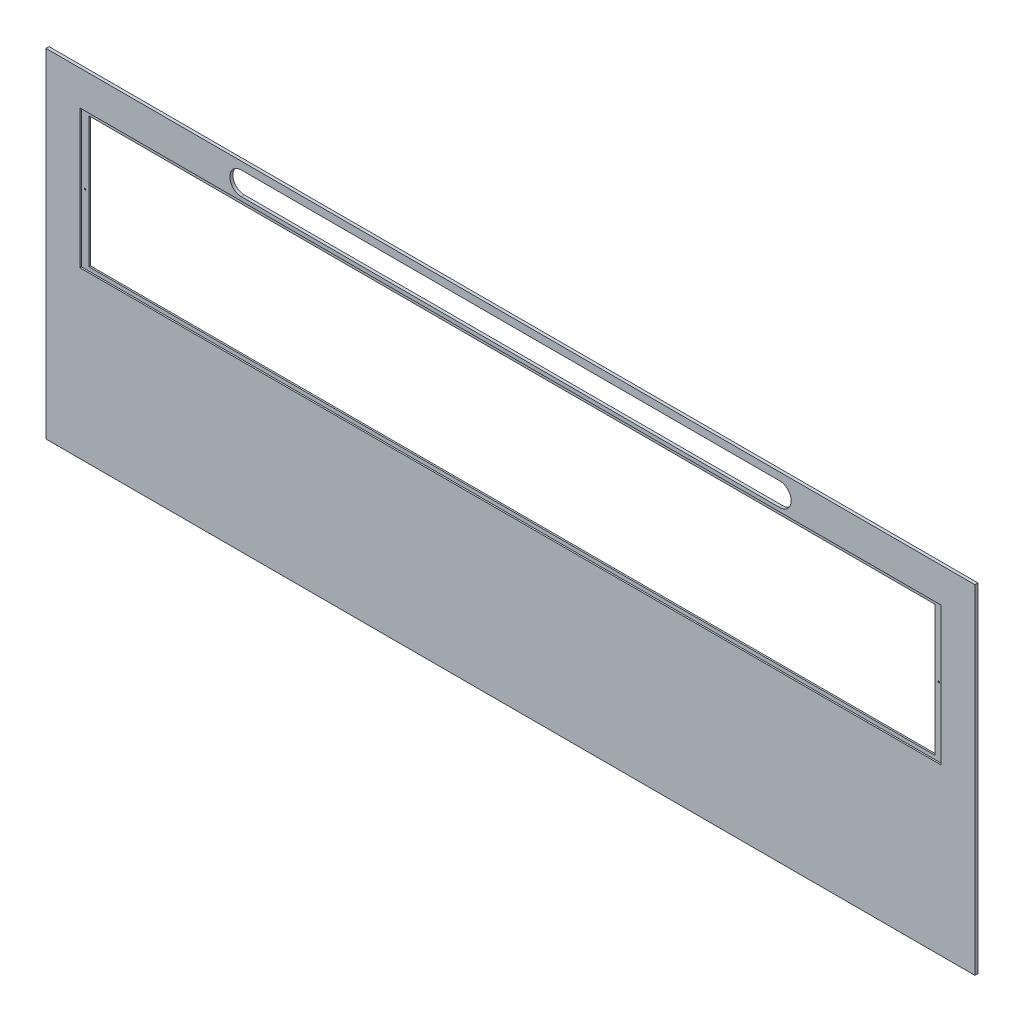
ISO-10303-21;
HEADER;
FILE_DESCRIPTION(('STEP AP214'),'2;1');
FILE_NAME('part.step','',(''),(''),'','','');
FILE_SCHEMA(('AUTOMOTIVE_DESIGN { 1 0 10303 214 1 1 1 1 }'));
ENDSEC;
DATA;
#1=APPLICATION_CONTEXT('core data for automotive mechanical design processes');
#2=APPLICATION_PROTOCOL_DEFINITION('international standard','automotive_design',2000,#1);
#3=PRODUCT_CONTEXT('',#1,'mechanical');
#4=PRODUCT('Part','Part','',(#3));
#5=PRODUCT_RELATED_PRODUCT_CATEGORY('part','',(#4));
#6=PRODUCT_DEFINITION_FORMATION('','',#4);
#7=PRODUCT_DEFINITION_CONTEXT('part definition',#1,'design');
#8=PRODUCT_DEFINITION('design','',#6,#7);
#9=PRODUCT_DEFINITION_SHAPE('','',#8);
#10=(LENGTH_UNIT() NAMED_UNIT(*) SI_UNIT(.MILLI.,.METRE.));
#11=(NAMED_UNIT(*) PLANE_ANGLE_UNIT() SI_UNIT($,.RADIAN.));
#12=(NAMED_UNIT(*) SI_UNIT($,.STERADIAN.) SOLID_ANGLE_UNIT());
#13=UNCERTAINTY_MEASURE_WITH_UNIT(LENGTH_MEASURE(1.E-05),#10,'distance_accuracy_value','');
#14=(GEOMETRIC_REPRESENTATION_CONTEXT(3) GLOBAL_UNCERTAINTY_ASSIGNED_CONTEXT((#13)) GLOBAL_UNIT_ASSIGNED_CONTEXT((#10,
#11,#12)) REPRESENTATION_CONTEXT('',''));
#15=CARTESIAN_POINT('',(0.,0.,0.));
#16=DIRECTION('',(0.,0.,1.));
#17=DIRECTION('',(1.,0.,0.));
#18=AXIS2_PLACEMENT_3D('',#15,#16,#17);
#19=CARTESIAN_POINT('',(0.,0.,2.));
#20=DIRECTION('',(0.,0.,-1.));
#21=DIRECTION('',(-1.,0.,0.));
#22=AXIS2_PLACEMENT_3D('',#19,#20,#21);
#23=PLANE('',#22);
#24=CARTESIAN_POINT('',(555.,85.0000000000004,2.));
#25=DIRECTION('',(0.,0.,-1.));
#26=DIRECTION('',(-1.,0.,0.));
#27=AXIS2_PLACEMENT_3D('',#24,#25,#26);
#28=CIRCLE('',#27,1.00000000000005);
#29=CARTESIAN_POINT('',(554.,85.0000000000004,2.));
#30=VERTEX_POINT('',#29);
#31=EDGE_CURVE('E574',#30,#30,#28,.T.);
#32=ORIENTED_EDGE('',*,*,#31,.T.);
#33=EDGE_LOOP('',(#32));
#34=FACE_BOUND('',#33,.T.);
#35=CARTESIAN_POINT('',(-555.,85.0000000000004,2.));
#36=DIRECTION('',(0.,0.,1.));
#37=DIRECTION('',(1.,0.,0.));
#38=AXIS2_PLACEMENT_3D('',#35,#36,#37);
#39=CIRCLE('',#38,1.00000000000005);
#40=CARTESIAN_POINT('',(-554.,85.0000000000004,2.));
#41=VERTEX_POINT('',#40);
#42=EDGE_CURVE('E181',#41,#41,#39,.T.);
#43=ORIENTED_EDGE('',*,*,#42,.F.);
#44=EDGE_LOOP('',(#43));
#45=FACE_BOUND('',#44,.T.);
#46=DIRECTION('',(0.,1.,0.));
#47=VECTOR('',#46,1.);
#48=CARTESIAN_POINT('',(560.,-4.99999999999989,2.));
#49=LINE('',#48,#47);
#50=CARTESIAN_POINT('',(560.,-4.99999999999989,2.));
#51=VERTEX_POINT('',#50);
#52=CARTESIAN_POINT('',(560.,175.,2.));
#53=VERTEX_POINT('',#52);
#54=EDGE_CURVE('E205',#51,#53,#49,.T.);
#55=ORIENTED_EDGE('',*,*,#54,.T.);
#56=DIRECTION('',(-1.,0.,0.));
#57=VECTOR('',#56,1.);
#58=CARTESIAN_POINT('',(-560.,175.,2.));
#59=LINE('',#58,#57);
#60=CARTESIAN_POINT('',(-560.,175.,2.));
#61=VERTEX_POINT('',#60);
#62=EDGE_CURVE('E209',#53,#61,#59,.T.);
#63=ORIENTED_EDGE('',*,*,#62,.T.);
#64=DIRECTION('',(0.,-1.,0.));
#65=VECTOR('',#64,1.);
#66=CARTESIAN_POINT('',(-560.,175.,2.));
#67=LINE('',#66,#65);
#68=CARTESIAN_POINT('',(-560.,-4.99999999999989,2.));
#69=VERTEX_POINT('',#68);
#70=EDGE_CURVE('E214',#61,#69,#67,.T.);
#71=ORIENTED_EDGE('',*,*,#70,.T.);
#72=DIRECTION('',(1.,0.,0.));
#73=VECTOR('',#72,1.);
#74=CARTESIAN_POINT('',(-560.,-4.99999999999989,2.));
#75=LINE('',#74,#73);
#76=EDGE_CURVE('E218',#69,#51,#75,.T.);
#77=ORIENTED_EDGE('',*,*,#76,.T.);
#78=EDGE_LOOP('',(#55,#63,#71,#77));
#79=FACE_BOUND('',#78,.T.);
#80=DIRECTION('',(0.,1.,0.));
#81=VECTOR('',#80,1.);
#82=CARTESIAN_POINT('',(550.,0.,2.));
#83=LINE('',#82,#81);
#84=CARTESIAN_POINT('',(550.,0.,2.));
#85=VERTEX_POINT('',#84);
#86=CARTESIAN_POINT('',(550.,170.,2.));
#87=VERTEX_POINT('',#86);
#88=EDGE_CURVE('E157',#85,#87,#83,.T.);
#89=ORIENTED_EDGE('',*,*,#88,.F.);
#90=DIRECTION('',(1.,0.,0.));
#91=VECTOR('',#90,1.);
#92=CARTESIAN_POINT('',(-550.,1.94289029309402E-13,2.));
#93=LINE('',#92,#91);
#94=CARTESIAN_POINT('',(-550.,1.94289029309402E-13,2.));
#95=VERTEX_POINT('',#94);
#96=EDGE_CURVE('E175',#95,#85,#93,.T.);
#97=ORIENTED_EDGE('',*,*,#96,.F.);
#98=DIRECTION('',(0.,-1.,0.));
#99=VECTOR('',#98,1.);
#100=CARTESIAN_POINT('',(-550.,170.,2.));
#101=LINE('',#100,#99);
#102=CARTESIAN_POINT('',(-550.,170.,2.));
#103=VERTEX_POINT('',#102);
#104=EDGE_CURVE('E54',#103,#95,#101,.T.);
#105=ORIENTED_EDGE('',*,*,#104,.F.);
#106=DIRECTION('',(-1.,0.,0.));
#107=VECTOR('',#106,1.);
#108=CARTESIAN_POINT('',(-550.,170.,2.));
#109=LINE('',#108,#107);
#110=EDGE_CURVE('E190',#87,#103,#109,.T.);
#111=ORIENTED_EDGE('',*,*,#110,.F.);
#112=EDGE_LOOP('',(#89,#97,#105,#111));
#113=FACE_BOUND('',#112,.T.);
#114=ADVANCED_FACE('F38',(#34,#45,#79,#113),#23,.F.);
#115=CARTESIAN_POINT('',(604.,-220.,4.));
#116=DIRECTION('',(-1.,0.,0.));
#117=DIRECTION('',(0.,0.,1.));
#118=AXIS2_PLACEMENT_3D('',#115,#116,#117);
#119=PLANE('',#118);
#120=DIRECTION('',(0.,1.,0.));
#121=VECTOR('',#120,1.);
#122=CARTESIAN_POINT('',(604.,-220.,0.));
#123=LINE('',#122,#121);
#124=CARTESIAN_POINT('',(604.,-220.,0.));
#125=VERTEX_POINT('',#124);
#126=CARTESIAN_POINT('',(604.,220.,0.));
#127=VERTEX_POINT('',#126);
#128=EDGE_CURVE('E267',#125,#127,#123,.T.);
#129=ORIENTED_EDGE('',*,*,#128,.T.);
#130=DIRECTION('',(0.,0.,-1.));
#131=VECTOR('',#130,1.);
#132=CARTESIAN_POINT('',(604.,220.,4.));
#133=LINE('',#132,#131);
#134=CARTESIAN_POINT('',(604.,220.,4.));
#135=VERTEX_POINT('',#134);
#136=EDGE_CURVE('E314',#135,#127,#133,.T.);
#137=ORIENTED_EDGE('',*,*,#136,.F.);
#138=DIRECTION('',(0.,1.,0.));
#139=VECTOR('',#138,1.);
#140=CARTESIAN_POINT('',(604.,-220.,4.));
#141=LINE('',#140,#139);
#142=CARTESIAN_POINT('',(604.,-220.,4.));
#143=VERTEX_POINT('',#142);
#144=EDGE_CURVE('E277',#143,#135,#141,.T.);
#145=ORIENTED_EDGE('',*,*,#144,.F.);
#146=DIRECTION('',(0.,0.,-1.));
#147=VECTOR('',#146,1.);
#148=CARTESIAN_POINT('',(604.,-220.,4.));
#149=LINE('',#148,#147);
#150=EDGE_CURVE('E291',#143,#125,#149,.T.);
#151=ORIENTED_EDGE('',*,*,#150,.T.);
#152=EDGE_LOOP('',(#129,#137,#145,#151));
#153=FACE_BOUND('',#152,.T.);
#154=ADVANCED_FACE('F40',(#153),#119,.F.);
#155=CARTESIAN_POINT('',(-604.,220.,4.));
#156=DIRECTION('',(0.,-1.,0.));
#157=DIRECTION('',(0.,0.,-1.));
#158=AXIS2_PLACEMENT_3D('',#155,#156,#157);
#159=PLANE('',#158);
#160=DIRECTION('',(-1.,0.,0.));
#161=VECTOR('',#160,1.);
#162=CARTESIAN_POINT('',(-604.,220.,0.));
#163=LINE('',#162,#161);
#164=CARTESIAN_POINT('',(-604.,220.,0.));
#165=VERTEX_POINT('',#164);
#166=EDGE_CURVE('E295',#127,#165,#163,.T.);
#167=ORIENTED_EDGE('',*,*,#166,.T.);
#168=DIRECTION('',(0.,0.,-1.));
#169=VECTOR('',#168,1.);
#170=CARTESIAN_POINT('',(-604.,220.,4.));
#171=LINE('',#170,#169);
#172=CARTESIAN_POINT('',(-604.,220.,4.));
#173=VERTEX_POINT('',#172);
#174=EDGE_CURVE('E310',#173,#165,#171,.T.);
#175=ORIENTED_EDGE('',*,*,#174,.F.);
#176=DIRECTION('',(-1.,0.,0.));
#177=VECTOR('',#176,1.);
#178=CARTESIAN_POINT('',(-604.,220.,4.));
#179=LINE('',#178,#177);
#180=EDGE_CURVE('E281',#135,#173,#179,.T.);
#181=ORIENTED_EDGE('',*,*,#180,.F.);
#182=ORIENTED_EDGE('',*,*,#136,.T.);
#183=EDGE_LOOP('',(#167,#175,#181,#182));
#184=FACE_BOUND('',#183,.T.);
#185=ADVANCED_FACE('F360',(#184),#159,.F.);
#186=CARTESIAN_POINT('',(-604.,-220.,4.));
#187=DIRECTION('',(1.,0.,0.));
#188=DIRECTION('',(0.,0.,-1.));
#189=AXIS2_PLACEMENT_3D('',#186,#187,#188);
#190=PLANE('',#189);
#191=DIRECTION('',(0.,-1.,0.));
#192=VECTOR('',#191,1.);
#193=CARTESIAN_POINT('',(-604.,-220.,0.));
#194=LINE('',#193,#192);
#195=CARTESIAN_POINT('',(-604.,-220.,0.));
#196=VERTEX_POINT('',#195);
#197=EDGE_CURVE('E298',#165,#196,#194,.T.);
#198=ORIENTED_EDGE('',*,*,#197,.T.);
#199=DIRECTION('',(0.,0.,-1.));
#200=VECTOR('',#199,1.);
#201=CARTESIAN_POINT('',(-604.,-220.,4.));
#202=LINE('',#201,#200);
#203=CARTESIAN_POINT('',(-604.,-220.,4.));
#204=VERTEX_POINT('',#203);
#205=EDGE_CURVE('E306',#204,#196,#202,.T.);
#206=ORIENTED_EDGE('',*,*,#205,.F.);
#207=DIRECTION('',(0.,-1.,0.));
#208=VECTOR('',#207,1.);
#209=CARTESIAN_POINT('',(-604.,-220.,4.));
#210=LINE('',#209,#208);
#211=EDGE_CURVE('E285',#173,#204,#210,.T.);
#212=ORIENTED_EDGE('',*,*,#211,.F.);
#213=ORIENTED_EDGE('',*,*,#174,.T.);
#214=EDGE_LOOP('',(#198,#206,#212,#213));
#215=FACE_BOUND('',#214,.T.);
#216=ADVANCED_FACE('F365',(#215),#190,.F.);
#217=CARTESIAN_POINT('',(-604.,-220.,4.));
#218=DIRECTION('',(0.,1.,0.));
#219=DIRECTION('',(0.,0.,1.));
#220=AXIS2_PLACEMENT_3D('',#217,#218,#219);
#221=PLANE('',#220);
#222=DIRECTION('',(1.,0.,0.));
#223=VECTOR('',#222,1.);
#224=CARTESIAN_POINT('',(-604.,-220.,0.));
#225=LINE('',#224,#223);
#226=EDGE_CURVE('E282',#196,#125,#225,.T.);
#227=ORIENTED_EDGE('',*,*,#226,.T.);
#228=ORIENTED_EDGE('',*,*,#150,.F.);
#229=DIRECTION('',(1.,0.,0.));
#230=VECTOR('',#229,1.);
#231=CARTESIAN_POINT('',(-604.,-220.,4.));
#232=LINE('',#231,#230);
#233=EDGE_CURVE('E288',#204,#143,#232,.T.);
#234=ORIENTED_EDGE('',*,*,#233,.F.);
#235=ORIENTED_EDGE('',*,*,#205,.T.);
#236=EDGE_LOOP('',(#227,#228,#234,#235));
#237=FACE_BOUND('',#236,.T.);
#238=ADVANCED_FACE('F349',(#237),#221,.F.);
#239=CARTESIAN_POINT('',(0.,0.,4.));
#240=DIRECTION('',(0.,0.,-1.));
#241=DIRECTION('',(-1.,0.,0.));
#242=AXIS2_PLACEMENT_3D('',#239,#240,#241);
#243=PLANE('',#242);
#244=DIRECTION('',(-1.,0.,0.));
#245=VECTOR('',#244,1.);
#246=CARTESIAN_POINT('',(-560.,175.,4.));
#247=LINE('',#246,#245);
#248=CARTESIAN_POINT('',(560.,175.,4.));
#249=VERTEX_POINT('',#248);
#250=CARTESIAN_POINT('',(-560.,175.,4.));
#251=VERTEX_POINT('',#250);
#252=EDGE_CURVE('E225',#249,#251,#247,.T.);
#253=ORIENTED_EDGE('',*,*,#252,.F.);
#254=DIRECTION('',(0.,1.,0.));
#255=VECTOR('',#254,1.);
#256=CARTESIAN_POINT('',(560.,-4.99999999999989,4.));
#257=LINE('',#256,#255);
#258=CARTESIAN_POINT('',(560.,-4.99999999999989,4.));
#259=VERTEX_POINT('',#258);
#260=EDGE_CURVE('E199',#259,#249,#257,.T.);
#261=ORIENTED_EDGE('',*,*,#260,.F.);
#262=DIRECTION('',(1.,0.,0.));
#263=VECTOR('',#262,1.);
#264=CARTESIAN_POINT('',(-560.,-4.99999999999989,4.));
#265=LINE('',#264,#263);
#266=CARTESIAN_POINT('',(-560.,-4.99999999999989,4.));
#267=VERTEX_POINT('',#266);
#268=EDGE_CURVE('E210',#267,#259,#265,.T.);
#269=ORIENTED_EDGE('',*,*,#268,.F.);
#270=DIRECTION('',(0.,-1.,0.));
#271=VECTOR('',#270,1.);
#272=CARTESIAN_POINT('',(-560.,175.,4.));
#273=LINE('',#272,#271);
#274=EDGE_CURVE('E229',#251,#267,#273,.T.);
#275=ORIENTED_EDGE('',*,*,#274,.F.);
#276=EDGE_LOOP('',(#253,#261,#269,#275));
#277=FACE_BOUND('',#276,.T.);
#278=DIRECTION('',(-1.,0.,0.));
#279=VECTOR('',#278,1.);
#280=CARTESIAN_POINT('',(-350.,210.,4.));
#281=LINE('',#280,#279);
#282=CARTESIAN_POINT('',(350.,210.,4.));
#283=VERTEX_POINT('',#282);
#284=CARTESIAN_POINT('',(-350.,210.,4.));
#285=VERTEX_POINT('',#284);
#286=EDGE_CURVE('E251',#283,#285,#281,.T.);
#287=ORIENTED_EDGE('',*,*,#286,.F.);
#288=CARTESIAN_POINT('',(350.,195.,4.));
#289=DIRECTION('',(0.,0.,1.));
#290=DIRECTION('',(-1.,0.,0.));
#291=AXIS2_PLACEMENT_3D('',#288,#289,#290);
#292=CIRCLE('',#291,15.0000000000001);
#293=CARTESIAN_POINT('',(350.,180.,4.));
#294=VERTEX_POINT('',#293);
#295=EDGE_CURVE('E239',#294,#283,#292,.T.);
#296=ORIENTED_EDGE('',*,*,#295,.F.);
#297=DIRECTION('',(1.,0.,0.));
#298=VECTOR('',#297,1.);
#299=CARTESIAN_POINT('',(-350.,180.,4.));
#300=LINE('',#299,#298);
#301=CARTESIAN_POINT('',(-350.,180.,4.));
#302=VERTEX_POINT('',#301);
#303=EDGE_CURVE('E259',#302,#294,#300,.T.);
#304=ORIENTED_EDGE('',*,*,#303,.F.);
#305=CARTESIAN_POINT('',(-350.,195.,4.));
#306=DIRECTION('',(0.,0.,1.));
#307=DIRECTION('',(1.,0.,0.));
#308=AXIS2_PLACEMENT_3D('',#305,#306,#307);
#309=CIRCLE('',#308,15.);
#310=EDGE_CURVE('E255',#285,#302,#309,.T.);
#311=ORIENTED_EDGE('',*,*,#310,.F.);
#312=EDGE_LOOP('',(#287,#296,#304,#311));
#313=FACE_BOUND('',#312,.T.);
#314=ORIENTED_EDGE('',*,*,#144,.T.);
#315=ORIENTED_EDGE('',*,*,#180,.T.);
#316=ORIENTED_EDGE('',*,*,#211,.T.);
#317=ORIENTED_EDGE('',*,*,#233,.T.);
#318=EDGE_LOOP('',(#314,#315,#316,#317));
#319=FACE_BOUND('',#318,.T.);
#320=ADVANCED_FACE('F346',(#277,#313,#319),#243,.F.);
#321=CARTESIAN_POINT('',(0.,0.,0.));
#322=DIRECTION('',(0.,0.,-1.));
#323=DIRECTION('',(-1.,0.,0.));
#324=AXIS2_PLACEMENT_3D('',#321,#322,#323);
#325=PLANE('',#324);
#326=DIRECTION('',(0.,1.,0.));
#327=VECTOR('',#326,1.);
#328=CARTESIAN_POINT('',(550.,0.,0.));
#329=LINE('',#328,#327);
#330=CARTESIAN_POINT('',(550.,0.,0.));
#331=VERTEX_POINT('',#330);
#332=CARTESIAN_POINT('',(550.,170.,0.));
#333=VERTEX_POINT('',#332);
#334=EDGE_CURVE('E154',#331,#333,#329,.T.);
#335=ORIENTED_EDGE('',*,*,#334,.T.);
#336=DIRECTION('',(-1.,0.,0.));
#337=VECTOR('',#336,1.);
#338=CARTESIAN_POINT('',(-550.,170.,0.));
#339=LINE('',#338,#337);
#340=CARTESIAN_POINT('',(-550.,170.,0.));
#341=VERTEX_POINT('',#340);
#342=EDGE_CURVE('E166',#333,#341,#339,.T.);
#343=ORIENTED_EDGE('',*,*,#342,.T.);
#344=DIRECTION('',(0.,-1.,0.));
#345=VECTOR('',#344,1.);
#346=CARTESIAN_POINT('',(-550.,170.,0.));
#347=LINE('',#346,#345);
#348=CARTESIAN_POINT('',(-550.,1.94289029309402E-13,0.));
#349=VERTEX_POINT('',#348);
#350=EDGE_CURVE('E59',#341,#349,#347,.T.);
#351=ORIENTED_EDGE('',*,*,#350,.T.);
#352=DIRECTION('',(1.,0.,0.));
#353=VECTOR('',#352,1.);
#354=CARTESIAN_POINT('',(-550.,1.94289029309402E-13,0.));
#355=LINE('',#354,#353);
#356=EDGE_CURVE('E163',#349,#331,#355,.T.);
#357=ORIENTED_EDGE('',*,*,#356,.T.);
#358=EDGE_LOOP('',(#335,#343,#351,#357));
#359=FACE_BOUND('',#358,.T.);
#360=CARTESIAN_POINT('',(350.,195.,0.));
#361=DIRECTION('',(0.,0.,-1.));
#362=DIRECTION('',(-1.,0.,0.));
#363=AXIS2_PLACEMENT_3D('',#360,#361,#362);
#364=CIRCLE('',#363,15.0000000000001);
#365=CARTESIAN_POINT('',(350.,210.,0.));
#366=VERTEX_POINT('',#365);
#367=CARTESIAN_POINT('',(350.,180.,0.));
#368=VERTEX_POINT('',#367);
#369=EDGE_CURVE('E11',#366,#368,#364,.T.);
#370=ORIENTED_EDGE('',*,*,#369,.F.);
#371=DIRECTION('',(1.,0.,0.));
#372=VECTOR('',#371,1.);
#373=CARTESIAN_POINT('',(0.,210.,0.));
#374=LINE('',#373,#372);
#375=CARTESIAN_POINT('',(-350.,210.,0.));
#376=VERTEX_POINT('',#375);
#377=EDGE_CURVE('E318',#376,#366,#374,.T.);
#378=ORIENTED_EDGE('',*,*,#377,.F.);
#379=CARTESIAN_POINT('',(-350.,195.,0.));
#380=DIRECTION('',(0.,0.,-1.));
#381=DIRECTION('',(-1.,0.,0.));
#382=AXIS2_PLACEMENT_3D('',#379,#380,#381);
#383=CIRCLE('',#382,15.);
#384=CARTESIAN_POINT('',(-350.,180.,0.));
#385=VERTEX_POINT('',#384);
#386=EDGE_CURVE('E321',#385,#376,#383,.T.);
#387=ORIENTED_EDGE('',*,*,#386,.F.);
#388=DIRECTION('',(-1.,0.,0.));
#389=VECTOR('',#388,1.);
#390=CARTESIAN_POINT('',(0.,180.,0.));
#391=LINE('',#390,#389);
#392=EDGE_CURVE('E47',#368,#385,#391,.T.);
#393=ORIENTED_EDGE('',*,*,#392,.F.);
#394=EDGE_LOOP('',(#370,#378,#387,#393));
#395=FACE_BOUND('',#394,.T.);
#396=ORIENTED_EDGE('',*,*,#128,.F.);
#397=ORIENTED_EDGE('',*,*,#226,.F.);
#398=ORIENTED_EDGE('',*,*,#197,.F.);
#399=ORIENTED_EDGE('',*,*,#166,.F.);
#400=EDGE_LOOP('',(#396,#397,#398,#399));
#401=FACE_BOUND('',#400,.T.);
#402=ADVANCED_FACE('F171',(#359,#395,#401),#325,.T.);
#403=CARTESIAN_POINT('',(350.,195.,-6.));
#404=DIRECTION('',(0.,0.,1.));
#405=DIRECTION('',(1.,0.,0.));
#406=AXIS2_PLACEMENT_3D('',#403,#404,#405);
#407=CYLINDRICAL_SURFACE('',#406,15.0000000000001);
#408=ORIENTED_EDGE('',*,*,#369,.T.);
#409=DIRECTION('',(0.,0.,1.));
#410=VECTOR('',#409,1.);
#411=CARTESIAN_POINT('',(350.,180.,-6.));
#412=LINE('',#411,#410);
#413=EDGE_CURVE('E264',#368,#294,#412,.T.);
#414=ORIENTED_EDGE('',*,*,#413,.T.);
#415=ORIENTED_EDGE('',*,*,#295,.T.);
#416=DIRECTION('',(0.,0.,1.));
#417=VECTOR('',#416,1.);
#418=CARTESIAN_POINT('',(350.,210.,-6.));
#419=LINE('',#418,#417);
#420=EDGE_CURVE('E263',#366,#283,#419,.T.);
#421=ORIENTED_EDGE('',*,*,#420,.F.);
#422=EDGE_LOOP('',(#408,#414,#415,#421));
#423=FACE_BOUND('',#422,.T.);
#424=ADVANCED_FACE('F343',(#423),#407,.F.);
#425=CARTESIAN_POINT('',(-350.,180.,-6.));
#426=DIRECTION('',(0.,-1.,0.));
#427=DIRECTION('',(0.,0.,-1.));
#428=AXIS2_PLACEMENT_3D('',#425,#426,#427);
#429=PLANE('',#428);
#430=ORIENTED_EDGE('',*,*,#392,.T.);
#431=DIRECTION('',(0.,0.,1.));
#432=VECTOR('',#431,1.);
#433=CARTESIAN_POINT('',(-350.,180.,-6.));
#434=LINE('',#433,#432);
#435=EDGE_CURVE('E268',#385,#302,#434,.T.);
#436=ORIENTED_EDGE('',*,*,#435,.T.);
#437=ORIENTED_EDGE('',*,*,#303,.T.);
#438=ORIENTED_EDGE('',*,*,#413,.F.);
#439=EDGE_LOOP('',(#430,#436,#437,#438));
#440=FACE_BOUND('',#439,.T.);
#441=ADVANCED_FACE('F329',(#440),#429,.F.);
#442=CARTESIAN_POINT('',(-350.,195.,-6.));
#443=DIRECTION('',(0.,0.,1.));
#444=DIRECTION('',(1.,0.,0.));
#445=AXIS2_PLACEMENT_3D('',#442,#443,#444);
#446=CYLINDRICAL_SURFACE('',#445,15.);
#447=ORIENTED_EDGE('',*,*,#386,.T.);
#448=DIRECTION('',(0.,0.,1.));
#449=VECTOR('',#448,1.);
#450=CARTESIAN_POINT('',(-350.,210.,-6.));
#451=LINE('',#450,#449);
#452=EDGE_CURVE('E271',#376,#285,#451,.T.);
#453=ORIENTED_EDGE('',*,*,#452,.T.);
#454=ORIENTED_EDGE('',*,*,#310,.T.);
#455=ORIENTED_EDGE('',*,*,#435,.F.);
#456=EDGE_LOOP('',(#447,#453,#454,#455));
#457=FACE_BOUND('',#456,.T.);
#458=ADVANCED_FACE('F333',(#457),#446,.F.);
#459=CARTESIAN_POINT('',(-350.,210.,-6.));
#460=DIRECTION('',(0.,1.,0.));
#461=DIRECTION('',(-1.,0.,0.));
#462=AXIS2_PLACEMENT_3D('',#459,#460,#461);
#463=PLANE('',#462);
#464=ORIENTED_EDGE('',*,*,#377,.T.);
#465=ORIENTED_EDGE('',*,*,#420,.T.);
#466=ORIENTED_EDGE('',*,*,#286,.T.);
#467=ORIENTED_EDGE('',*,*,#452,.F.);
#468=EDGE_LOOP('',(#464,#465,#466,#467));
#469=FACE_BOUND('',#468,.T.);
#470=ADVANCED_FACE('F340',(#469),#463,.F.);
#471=CARTESIAN_POINT('',(560.,-4.99999999999989,2.));
#472=DIRECTION('',(1.,0.,0.));
#473=DIRECTION('',(0.,0.,-1.));
#474=AXIS2_PLACEMENT_3D('',#471,#472,#473);
#475=PLANE('',#474);
#476=ORIENTED_EDGE('',*,*,#260,.T.);
#477=DIRECTION('',(0.,0.,1.));
#478=VECTOR('',#477,1.);
#479=CARTESIAN_POINT('',(560.,175.,2.));
#480=LINE('',#479,#478);
#481=EDGE_CURVE('E222',#53,#249,#480,.T.);
#482=ORIENTED_EDGE('',*,*,#481,.F.);
#483=ORIENTED_EDGE('',*,*,#54,.F.);
#484=DIRECTION('',(0.,0.,1.));
#485=VECTOR('',#484,1.);
#486=CARTESIAN_POINT('',(560.,-4.99999999999989,2.));
#487=LINE('',#486,#485);
#488=EDGE_CURVE('E236',#51,#259,#487,.T.);
#489=ORIENTED_EDGE('',*,*,#488,.T.);
#490=EDGE_LOOP('',(#476,#482,#483,#489));
#491=FACE_BOUND('',#490,.T.);
#492=ADVANCED_FACE('F392',(#491),#475,.F.);
#493=CARTESIAN_POINT('',(-560.,-4.99999999999989,2.));
#494=DIRECTION('',(0.,-1.,0.));
#495=DIRECTION('',(0.,0.,-1.));
#496=AXIS2_PLACEMENT_3D('',#493,#494,#495);
#497=PLANE('',#496);
#498=ORIENTED_EDGE('',*,*,#268,.T.);
#499=ORIENTED_EDGE('',*,*,#488,.F.);
#500=ORIENTED_EDGE('',*,*,#76,.F.);
#501=DIRECTION('',(0.,0.,1.));
#502=VECTOR('',#501,1.);
#503=CARTESIAN_POINT('',(-560.,-4.99999999999989,2.));
#504=LINE('',#503,#502);
#505=EDGE_CURVE('E240',#69,#267,#504,.T.);
#506=ORIENTED_EDGE('',*,*,#505,.T.);
#507=EDGE_LOOP('',(#498,#499,#500,#506));
#508=FACE_BOUND('',#507,.T.);
#509=ADVANCED_FACE('F388',(#508),#497,.F.);
#510=CARTESIAN_POINT('',(-560.,175.,2.));
#511=DIRECTION('',(-1.,0.,0.));
#512=DIRECTION('',(0.,0.,1.));
#513=AXIS2_PLACEMENT_3D('',#510,#511,#512);
#514=PLANE('',#513);
#515=ORIENTED_EDGE('',*,*,#274,.T.);
#516=ORIENTED_EDGE('',*,*,#505,.F.);
#517=ORIENTED_EDGE('',*,*,#70,.F.);
#518=DIRECTION('',(0.,0.,1.));
#519=VECTOR('',#518,1.);
#520=CARTESIAN_POINT('',(-560.,175.,2.));
#521=LINE('',#520,#519);
#522=EDGE_CURVE('E243',#61,#251,#521,.T.);
#523=ORIENTED_EDGE('',*,*,#522,.T.);
#524=EDGE_LOOP('',(#515,#516,#517,#523));
#525=FACE_BOUND('',#524,.T.);
#526=ADVANCED_FACE('F391',(#525),#514,.F.);
#527=CARTESIAN_POINT('',(-560.,175.,2.));
#528=DIRECTION('',(0.,1.,0.));
#529=DIRECTION('',(-1.,0.,0.));
#530=AXIS2_PLACEMENT_3D('',#527,#528,#529);
#531=PLANE('',#530);
#532=ORIENTED_EDGE('',*,*,#252,.T.);
#533=ORIENTED_EDGE('',*,*,#522,.F.);
#534=ORIENTED_EDGE('',*,*,#62,.F.);
#535=ORIENTED_EDGE('',*,*,#481,.T.);
#536=EDGE_LOOP('',(#532,#533,#534,#535));
#537=FACE_BOUND('',#536,.T.);
#538=ADVANCED_FACE('F396',(#537),#531,.F.);
#539=CARTESIAN_POINT('',(550.,0.,0.));
#540=DIRECTION('',(1.,0.,0.));
#541=DIRECTION('',(0.,0.,-1.));
#542=AXIS2_PLACEMENT_3D('',#539,#540,#541);
#543=PLANE('',#542);
#544=ORIENTED_EDGE('',*,*,#88,.T.);
#545=DIRECTION('',(0.,0.,1.));
#546=VECTOR('',#545,1.);
#547=CARTESIAN_POINT('',(550.,170.,0.));
#548=LINE('',#547,#546);
#549=EDGE_CURVE('E150',#333,#87,#548,.T.);
#550=ORIENTED_EDGE('',*,*,#549,.F.);
#551=ORIENTED_EDGE('',*,*,#334,.F.);
#552=DIRECTION('',(0.,0.,1.));
#553=VECTOR('',#552,1.);
#554=CARTESIAN_POINT('',(550.,0.,0.));
#555=LINE('',#554,#553);
#556=EDGE_CURVE('E196',#331,#85,#555,.T.);
#557=ORIENTED_EDGE('',*,*,#556,.T.);
#558=EDGE_LOOP('',(#544,#550,#551,#557));
#559=FACE_BOUND('',#558,.T.);
#560=ADVANCED_FACE('F152',(#559),#543,.F.);
#561=CARTESIAN_POINT('',(-550.,1.94289029309402E-13,0.));
#562=DIRECTION('',(0.,-1.,0.));
#563=DIRECTION('',(1.,0.,0.));
#564=AXIS2_PLACEMENT_3D('',#561,#562,#563);
#565=PLANE('',#564);
#566=ORIENTED_EDGE('',*,*,#96,.T.);
#567=ORIENTED_EDGE('',*,*,#556,.F.);
#568=ORIENTED_EDGE('',*,*,#356,.F.);
#569=DIRECTION('',(0.,0.,1.));
#570=VECTOR('',#569,1.);
#571=CARTESIAN_POINT('',(-550.,1.94289029309402E-13,0.));
#572=LINE('',#571,#570);
#573=EDGE_CURVE('E200',#349,#95,#572,.T.);
#574=ORIENTED_EDGE('',*,*,#573,.T.);
#575=EDGE_LOOP('',(#566,#567,#568,#574));
#576=FACE_BOUND('',#575,.T.);
#577=ADVANCED_FACE('F433',(#576),#565,.F.);
#578=CARTESIAN_POINT('',(-550.,170.,0.));
#579=DIRECTION('',(-1.,0.,0.));
#580=DIRECTION('',(0.,0.,1.));
#581=AXIS2_PLACEMENT_3D('',#578,#579,#580);
#582=PLANE('',#581);
#583=ORIENTED_EDGE('',*,*,#104,.T.);
#584=ORIENTED_EDGE('',*,*,#573,.F.);
#585=ORIENTED_EDGE('',*,*,#350,.F.);
#586=DIRECTION('',(0.,0.,1.));
#587=VECTOR('',#586,1.);
#588=CARTESIAN_POINT('',(-550.,170.,0.));
#589=LINE('',#588,#587);
#590=EDGE_CURVE('E162',#341,#103,#589,.T.);
#591=ORIENTED_EDGE('',*,*,#590,.T.);
#592=EDGE_LOOP('',(#583,#584,#585,#591));
#593=FACE_BOUND('',#592,.T.);
#594=ADVANCED_FACE('F439',(#593),#582,.F.);
#595=CARTESIAN_POINT('',(-550.,170.,0.));
#596=DIRECTION('',(0.,1.,0.));
#597=DIRECTION('',(-1.,0.,0.));
#598=AXIS2_PLACEMENT_3D('',#595,#596,#597);
#599=PLANE('',#598);
#600=ORIENTED_EDGE('',*,*,#110,.T.);
#601=ORIENTED_EDGE('',*,*,#590,.F.);
#602=ORIENTED_EDGE('',*,*,#342,.F.);
#603=ORIENTED_EDGE('',*,*,#549,.T.);
#604=EDGE_LOOP('',(#600,#601,#602,#603));
#605=FACE_BOUND('',#604,.T.);
#606=ADVANCED_FACE('F167',(#605),#599,.F.);
#607=CARTESIAN_POINT('',(-555.,85.0000000000004,1.));
#608=DIRECTION('',(0.,0.,1.));
#609=DIRECTION('',(1.,0.,0.));
#610=AXIS2_PLACEMENT_3D('',#607,#608,#609);
#611=CYLINDRICAL_SURFACE('',#610,1.00000000000005);
#612=CARTESIAN_POINT('',(-555.,85.0000000000004,1.));
#613=DIRECTION('',(0.,0.,1.));
#614=DIRECTION('',(1.,0.,0.));
#615=AXIS2_PLACEMENT_3D('',#612,#613,#614);
#616=CIRCLE('',#615,1.00000000000005);
#617=CARTESIAN_POINT('',(-554.,85.0000000000004,1.));
#618=VERTEX_POINT('',#617);
#619=EDGE_CURVE('E191',#618,#618,#616,.T.);
#620=ORIENTED_EDGE('',*,*,#619,.F.);
#621=EDGE_LOOP('',(#620));
#622=FACE_BOUND('',#621,.T.);
#623=ORIENTED_EDGE('',*,*,#42,.T.);
#624=EDGE_LOOP('',(#623));
#625=FACE_BOUND('',#624,.T.);
#626=ADVANCED_FACE('F453',(#622,#625),#611,.F.);
#627=CARTESIAN_POINT('',(-555.,85.0000000000004,1.));
#628=DIRECTION('',(0.,0.,1.));
#629=DIRECTION('',(1.,0.,0.));
#630=AXIS2_PLACEMENT_3D('',#627,#628,#629);
#631=PLANE('',#630);
#632=ORIENTED_EDGE('',*,*,#619,.T.);
#633=EDGE_LOOP('',(#632));
#634=FACE_BOUND('',#633,.T.);
#635=ADVANCED_FACE('F459',(#634),#631,.T.);
#636=CARTESIAN_POINT('',(555.,85.0000000000004,1.));
#637=DIRECTION('',(0.,0.,1.));
#638=DIRECTION('',(1.,0.,0.));
#639=AXIS2_PLACEMENT_3D('',#636,#637,#638);
#640=CYLINDRICAL_SURFACE('',#639,1.00000000000005);
#641=CARTESIAN_POINT('',(555.,85.0000000000004,1.));
#642=DIRECTION('',(0.,0.,-1.));
#643=DIRECTION('',(-1.,0.,0.));
#644=AXIS2_PLACEMENT_3D('',#641,#642,#643);
#645=CIRCLE('',#644,1.00000000000005);
#646=CARTESIAN_POINT('',(554.,85.0000000000004,1.));
#647=VERTEX_POINT('',#646);
#648=EDGE_CURVE('E572',#647,#647,#645,.T.);
#649=ORIENTED_EDGE('',*,*,#648,.T.);
#650=EDGE_LOOP('',(#649));
#651=FACE_BOUND('',#650,.T.);
#652=ORIENTED_EDGE('',*,*,#31,.F.);
#653=EDGE_LOOP('',(#652));
#654=FACE_BOUND('',#653,.T.);
#655=ADVANCED_FACE('F467',(#651,#654),#640,.F.);
#656=CARTESIAN_POINT('',(555.,85.0000000000004,1.));
#657=DIRECTION('',(0.,0.,1.));
#658=DIRECTION('',(-1.,0.,0.));
#659=AXIS2_PLACEMENT_3D('',#656,#657,#658);
#660=PLANE('',#659);
#661=ORIENTED_EDGE('',*,*,#648,.F.);
#662=EDGE_LOOP('',(#661));
#663=FACE_BOUND('',#662,.T.);
#664=ADVANCED_FACE('F475',(#663),#660,.T.);
#665=CLOSED_SHELL('',(#114,#154,#185,#216,#238,#320,#402,#424,#441,#458,#470,#492,#509,#526,
#538,#560,#577,#594,#606,#626,#635,#655,#664));
#666=MANIFOLD_SOLID_BREP('B2',#665);
#667=ADVANCED_BREP_SHAPE_REPRESENTATION('',(#18,#666),#14);
#668=SHAPE_DEFINITION_REPRESENTATION(#9,#667);
ENDSEC;
END-ISO-10303-21;
